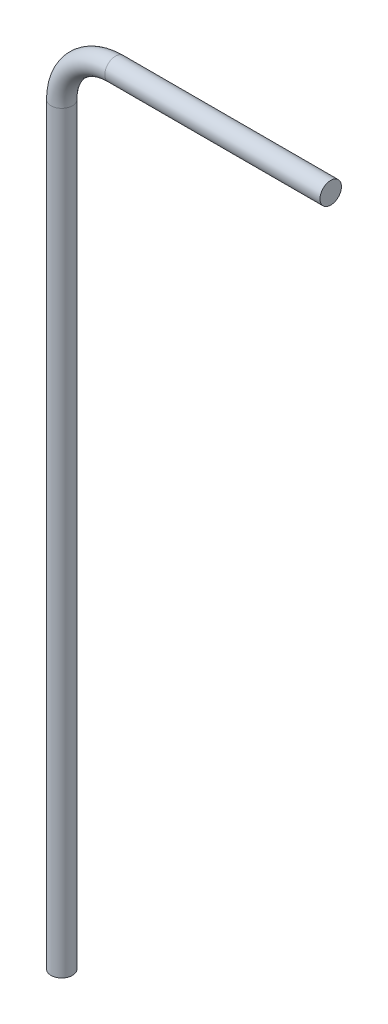
ISO-10303-21;
HEADER;
FILE_DESCRIPTION(('STEP AP214'),'2;1');
FILE_NAME('part.step','',(''),(''),'','','');
FILE_SCHEMA(('AUTOMOTIVE_DESIGN { 1 0 10303 214 1 1 1 1 }'));
ENDSEC;
DATA;
#1=APPLICATION_CONTEXT('core data for automotive mechanical design processes');
#2=APPLICATION_PROTOCOL_DEFINITION('international standard','automotive_design',2000,#1);
#3=PRODUCT_CONTEXT('',#1,'mechanical');
#4=PRODUCT('Part','Part','',(#3));
#5=PRODUCT_RELATED_PRODUCT_CATEGORY('part','',(#4));
#6=PRODUCT_DEFINITION_FORMATION('','',#4);
#7=PRODUCT_DEFINITION_CONTEXT('part definition',#1,'design');
#8=PRODUCT_DEFINITION('design','',#6,#7);
#9=PRODUCT_DEFINITION_SHAPE('','',#8);
#10=(LENGTH_UNIT() NAMED_UNIT(*) SI_UNIT(.MILLI.,.METRE.));
#11=(NAMED_UNIT(*) PLANE_ANGLE_UNIT() SI_UNIT($,.RADIAN.));
#12=(NAMED_UNIT(*) SI_UNIT($,.STERADIAN.) SOLID_ANGLE_UNIT());
#13=UNCERTAINTY_MEASURE_WITH_UNIT(LENGTH_MEASURE(1.E-05),#10,'distance_accuracy_value','');
#14=(GEOMETRIC_REPRESENTATION_CONTEXT(3) GLOBAL_UNCERTAINTY_ASSIGNED_CONTEXT((#13)) GLOBAL_UNIT_ASSIGNED_CONTEXT((#10,
#11,#12)) REPRESENTATION_CONTEXT('',''));
#15=CARTESIAN_POINT('',(0.,0.,0.));
#16=DIRECTION('',(0.,0.,1.));
#17=DIRECTION('',(1.,0.,0.));
#18=AXIS2_PLACEMENT_3D('',#15,#16,#17);
#19=CARTESIAN_POINT('',(0.,-89.0692342386486,0.));
#20=DIRECTION('',(0.,1.,0.));
#21=DIRECTION('',(0.,0.,-1.));
#22=AXIS2_PLACEMENT_3D('',#19,#20,#21);
#23=PLANE('',#22);
#24=CARTESIAN_POINT('',(0.,-89.0692342386486,0.));
#25=DIRECTION('',(0.,1.,0.));
#26=DIRECTION('',(0.,0.,-1.));
#27=AXIS2_PLACEMENT_3D('',#24,#25,#26);
#28=CIRCLE('',#27,2.);
#29=CARTESIAN_POINT('',(0.,-89.0692342386486,-2.));
#30=VERTEX_POINT('',#29);
#31=EDGE_CURVE('E54',#30,#30,#28,.T.);
#32=ORIENTED_EDGE('',*,*,#31,.F.);
#33=EDGE_LOOP('',(#32));
#34=FACE_BOUND('',#33,.T.);
#35=ADVANCED_FACE('F37',(#34),#23,.F.);
#36=CARTESIAN_POINT('',(50.,60.9307657613514,0.));
#37=DIRECTION('',(1.,0.,0.));
#38=DIRECTION('',(0.,0.,-1.));
#39=AXIS2_PLACEMENT_3D('',#36,#37,#38);
#40=PLANE('',#39);
#41=CARTESIAN_POINT('',(50.,60.9307657613514,0.));
#42=DIRECTION('',(1.,0.,0.));
#43=DIRECTION('',(0.,0.,-1.));
#44=AXIS2_PLACEMENT_3D('',#41,#42,#43);
#45=CIRCLE('',#44,2.);
#46=CARTESIAN_POINT('',(50.,60.9307657613514,-2.));
#47=VERTEX_POINT('',#46);
#48=EDGE_CURVE('E10',#47,#47,#45,.T.);
#49=ORIENTED_EDGE('',*,*,#48,.T.);
#50=EDGE_LOOP('',(#49));
#51=FACE_BOUND('',#50,.T.);
#52=ADVANCED_FACE('F64',(#51),#40,.T.);
#53=CARTESIAN_POINT('',(0.,-89.0692342386486,0.));
#54=DIRECTION('',(0.,1.,0.));
#55=DIRECTION('',(0.,0.,1.));
#56=AXIS2_PLACEMENT_3D('',#53,#54,#55);
#57=CYLINDRICAL_SURFACE('',#56,2.);
#58=CARTESIAN_POINT('',(0.,50.9307657613513,0.));
#59=DIRECTION('',(0.,1.,0.));
#60=DIRECTION('',(0.,0.,-1.));
#61=AXIS2_PLACEMENT_3D('',#58,#59,#60);
#62=CIRCLE('',#61,2.);
#63=CARTESIAN_POINT('',(-2.,50.9307657613513,0.));
#64=VERTEX_POINT('',#63);
#65=EDGE_CURVE('E49',#64,#64,#62,.T.);
#66=ORIENTED_EDGE('',*,*,#65,.F.);
#67=EDGE_LOOP('',(#66));
#68=FACE_BOUND('',#67,.T.);
#69=ORIENTED_EDGE('',*,*,#31,.T.);
#70=EDGE_LOOP('',(#69));
#71=FACE_BOUND('',#70,.T.);
#72=ADVANCED_FACE('F61',(#68,#71),#57,.T.);
#73=CARTESIAN_POINT('',(10.,50.9307657613514,0.));
#74=DIRECTION('',(0.,0.,-1.));
#75=DIRECTION('',(-1.,0.,0.));
#76=AXIS2_PLACEMENT_3D('',#73,#74,#75);
#77=TOROIDAL_SURFACE('',#76,10.,2.);
#78=CARTESIAN_POINT('',(9.99999999999964,60.9307657613517,0.));
#79=DIRECTION('',(1.,0.,0.));
#80=DIRECTION('',(0.,0.,-1.));
#81=AXIS2_PLACEMENT_3D('',#78,#79,#80);
#82=CIRCLE('',#81,2.);
#83=CARTESIAN_POINT('',(9.99999999999957,62.9307657613514,0.));
#84=VERTEX_POINT('',#83);
#85=EDGE_CURVE('E44',#84,#84,#82,.T.);
#86=CARTESIAN_POINT('',(10.,50.9307657613514,0.));
#87=DIRECTION('',(0.,0.,-1.));
#88=DIRECTION('',(-1.,0.,0.));
#89=AXIS2_PLACEMENT_3D('',#86,#87,#88);
#90=CIRCLE('',#89,12.);
#91=EDGE_CURVE('',#64,#84,#90,.T.);
#92=ORIENTED_EDGE('',*,*,#65,.T.);
#93=ORIENTED_EDGE('',*,*,#85,.F.);
#94=ORIENTED_EDGE('',*,*,#91,.T.);
#95=ORIENTED_EDGE('',*,*,#91,.F.);
#96=EDGE_LOOP('',(#92,#94,#93,#95));
#97=FACE_BOUND('',#96,.T.);
#98=ADVANCED_FACE('F70',(#97),#77,.T.);
#99=CARTESIAN_POINT('',(10.0000000000001,60.9307657613514,0.));
#100=DIRECTION('',(1.,0.,0.));
#101=DIRECTION('',(0.,0.,-1.));
#102=AXIS2_PLACEMENT_3D('',#99,#100,#101);
#103=CYLINDRICAL_SURFACE('',#102,2.);
#104=ORIENTED_EDGE('',*,*,#48,.F.);
#105=EDGE_LOOP('',(#104));
#106=FACE_BOUND('',#105,.T.);
#107=ORIENTED_EDGE('',*,*,#85,.T.);
#108=EDGE_LOOP('',(#107));
#109=FACE_BOUND('',#108,.T.);
#110=ADVANCED_FACE('F68',(#106,#109),#103,.T.);
#111=CLOSED_SHELL('',(#35,#52,#72,#98,#110));
#112=MANIFOLD_SOLID_BREP('B2',#111);
#113=ADVANCED_BREP_SHAPE_REPRESENTATION('',(#18,#112),#14);
#114=SHAPE_DEFINITION_REPRESENTATION(#9,#113);
ENDSEC;
END-ISO-10303-21;
